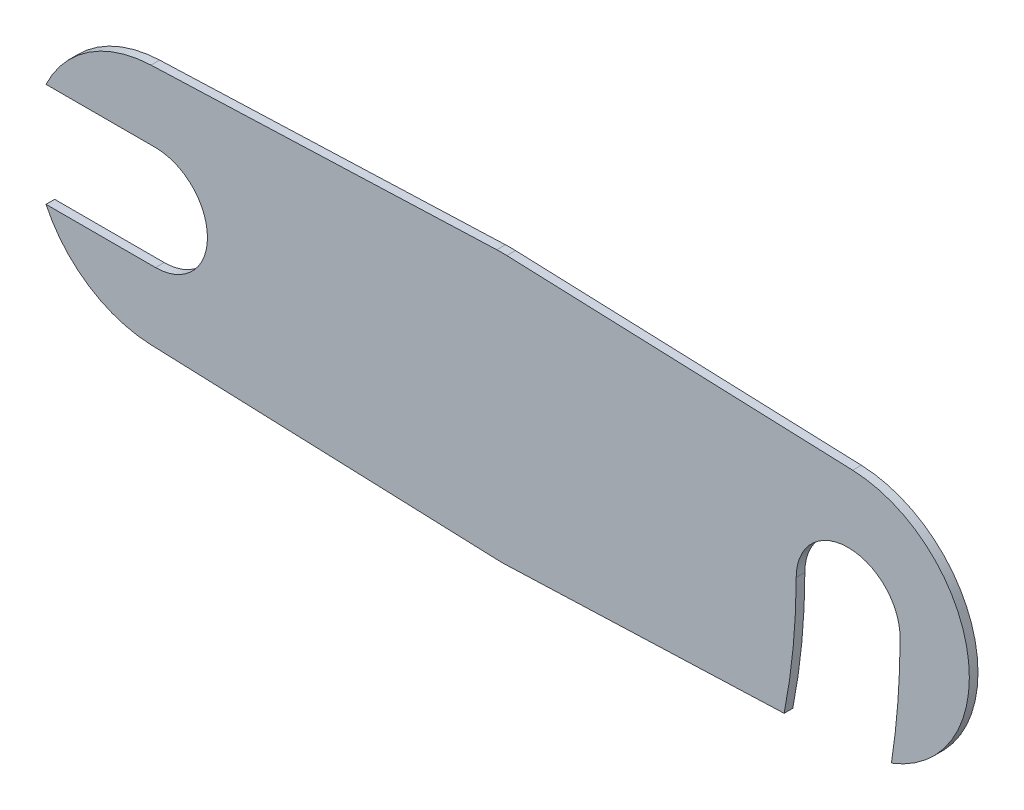
ISO-10303-21;
HEADER;
FILE_DESCRIPTION(('STEP AP214'),'2;1');
FILE_NAME('part.step','',(''),(''),'','','');
FILE_SCHEMA(('AUTOMOTIVE_DESIGN { 1 0 10303 214 1 1 1 1 }'));
ENDSEC;
DATA;
#1=APPLICATION_CONTEXT('core data for automotive mechanical design processes');
#2=APPLICATION_PROTOCOL_DEFINITION('international standard','automotive_design',2000,#1);
#3=PRODUCT_CONTEXT('',#1,'mechanical');
#4=PRODUCT('Part','Part','',(#3));
#5=PRODUCT_RELATED_PRODUCT_CATEGORY('part','',(#4));
#6=PRODUCT_DEFINITION_FORMATION('','',#4);
#7=PRODUCT_DEFINITION_CONTEXT('part definition',#1,'design');
#8=PRODUCT_DEFINITION('design','',#6,#7);
#9=PRODUCT_DEFINITION_SHAPE('','',#8);
#10=(LENGTH_UNIT() NAMED_UNIT(*) SI_UNIT(.MILLI.,.METRE.));
#11=(NAMED_UNIT(*) PLANE_ANGLE_UNIT() SI_UNIT($,.RADIAN.));
#12=(NAMED_UNIT(*) SI_UNIT($,.STERADIAN.) SOLID_ANGLE_UNIT());
#13=UNCERTAINTY_MEASURE_WITH_UNIT(LENGTH_MEASURE(1.E-05),#10,'distance_accuracy_value','');
#14=(GEOMETRIC_REPRESENTATION_CONTEXT(3) GLOBAL_UNCERTAINTY_ASSIGNED_CONTEXT((#13)) GLOBAL_UNIT_ASSIGNED_CONTEXT((#10,
#11,#12)) REPRESENTATION_CONTEXT('',''));
#15=CARTESIAN_POINT('',(0.,0.,0.));
#16=DIRECTION('',(0.,0.,1.));
#17=DIRECTION('',(1.,0.,0.));
#18=AXIS2_PLACEMENT_3D('',#15,#16,#17);
#19=CARTESIAN_POINT('',(0.,0.,0.5));
#20=DIRECTION('',(0.,0.,1.));
#21=DIRECTION('',(1.,0.,0.));
#22=AXIS2_PLACEMENT_3D('',#19,#20,#21);
#23=PLANE('',#22);
#24=CARTESIAN_POINT('',(20.,0.,0.5));
#25=DIRECTION('',(0.,0.,1.));
#26=DIRECTION('',(1.,0.,0.));
#27=AXIS2_PLACEMENT_3D('',#24,#25,#26);
#28=CIRCLE('',#27,3.);
#29=CARTESIAN_POINT('',(23.,0.,0.5));
#30=VERTEX_POINT('',#29);
#31=CARTESIAN_POINT('',(17.,0.,0.5));
#32=VERTEX_POINT('',#31);
#33=EDGE_CURVE('E159',#30,#32,#28,.T.);
#34=ORIENTED_EDGE('',*,*,#33,.F.);
#35=CARTESIAN_POINT('',(-20.,0.,0.5));
#36=DIRECTION('',(0.,0.,1.));
#37=DIRECTION('',(1.,0.,0.));
#38=AXIS2_PLACEMENT_3D('',#35,#36,#37);
#39=CIRCLE('',#38,43.);
#40=CARTESIAN_POINT('',(22.5,-6.53834841531101,0.5));
#41=VERTEX_POINT('',#40);
#42=EDGE_CURVE('E57',#30,#41,#39,.F.);
#43=ORIENTED_EDGE('',*,*,#42,.T.);
#44=CARTESIAN_POINT('',(20.,0.,0.5));
#45=DIRECTION('',(0.,0.,1.));
#46=DIRECTION('',(1.,0.,0.));
#47=AXIS2_PLACEMENT_3D('',#44,#45,#46);
#48=CIRCLE('',#47,7.);
#49=CARTESIAN_POINT('',(20.2625,6.99507639343561,0.5));
#50=VERTEX_POINT('',#49);
#51=EDGE_CURVE('E192',#41,#50,#48,.T.);
#52=ORIENTED_EDGE('',*,*,#51,.T.);
#53=DIRECTION('',(-0.999296627633657,0.0374999999999998,0.));
#54=VECTOR('',#53,1.);
#55=CARTESIAN_POINT('',(0.290624999999998,7.74454886416084,0.5));
#56=LINE('',#55,#54);
#57=CARTESIAN_POINT('',(0.290624999999998,7.74454886416084,0.5));
#58=VERTEX_POINT('',#57);
#59=EDGE_CURVE('E194',#50,#58,#56,.T.);
#60=ORIENTED_EDGE('',*,*,#59,.T.);
#61=CARTESIAN_POINT('',(0.,0.,0.5));
#62=DIRECTION('',(0.,0.,1.));
#63=DIRECTION('',(1.,0.,0.));
#64=AXIS2_PLACEMENT_3D('',#61,#62,#63);
#65=CIRCLE('',#64,7.75);
#66=CARTESIAN_POINT('',(-0.290625,7.74454886416085,0.5));
#67=VERTEX_POINT('',#66);
#68=EDGE_CURVE('E175',#58,#67,#65,.T.);
#69=ORIENTED_EDGE('',*,*,#68,.T.);
#70=DIRECTION('',(-0.999296627633657,-0.0375,0.));
#71=VECTOR('',#70,1.);
#72=CARTESIAN_POINT('',(-0.290625,7.74454886416085,0.5));
#73=LINE('',#72,#71);
#74=CARTESIAN_POINT('',(-20.2625,6.9950763934356,0.5));
#75=VERTEX_POINT('',#74);
#76=EDGE_CURVE('E178',#67,#75,#73,.T.);
#77=ORIENTED_EDGE('',*,*,#76,.T.);
#78=CARTESIAN_POINT('',(-20.,0.,0.5));
#79=DIRECTION('',(0.,0.,1.));
#80=DIRECTION('',(1.,0.,0.));
#81=AXIS2_PLACEMENT_3D('',#78,#79,#80);
#82=CIRCLE('',#81,7.);
#83=CARTESIAN_POINT('',(-26.3245553203368,3.,0.5));
#84=VERTEX_POINT('',#83);
#85=EDGE_CURVE('E182',#75,#84,#82,.T.);
#86=ORIENTED_EDGE('',*,*,#85,.T.);
#87=DIRECTION('',(-1.,0.,0.));
#88=VECTOR('',#87,1.);
#89=CARTESIAN_POINT('',(-20.,3.,0.5));
#90=LINE('',#89,#88);
#91=CARTESIAN_POINT('',(-20.,3.,0.5));
#92=VERTEX_POINT('',#91);
#93=EDGE_CURVE('E247',#92,#84,#90,.T.);
#94=ORIENTED_EDGE('',*,*,#93,.F.);
#95=CARTESIAN_POINT('',(-20.,0.,0.5));
#96=DIRECTION('',(0.,0.,1.));
#97=DIRECTION('',(1.,0.,0.));
#98=AXIS2_PLACEMENT_3D('',#95,#96,#97);
#99=CIRCLE('',#98,3.);
#100=CARTESIAN_POINT('',(-20.,-3.,0.5));
#101=VERTEX_POINT('',#100);
#102=EDGE_CURVE('E169',#101,#92,#99,.T.);
#103=ORIENTED_EDGE('',*,*,#102,.F.);
#104=DIRECTION('',(1.,0.,0.));
#105=VECTOR('',#104,1.);
#106=CARTESIAN_POINT('',(-20.,-3.,0.5));
#107=LINE('',#106,#105);
#108=CARTESIAN_POINT('',(-26.3245553203368,-3.,0.5));
#109=VERTEX_POINT('',#108);
#110=EDGE_CURVE('E243',#109,#101,#107,.T.);
#111=ORIENTED_EDGE('',*,*,#110,.F.);
#112=CARTESIAN_POINT('',(-20.2625,-6.9950763934356,0.5));
#113=VERTEX_POINT('',#112);
#114=EDGE_CURVE('E181',#109,#113,#82,.T.);
#115=ORIENTED_EDGE('',*,*,#114,.T.);
#116=DIRECTION('',(0.999296627633657,-0.0375,0.));
#117=VECTOR('',#116,1.);
#118=CARTESIAN_POINT('',(-0.290625,-7.74454886416085,0.5));
#119=LINE('',#118,#117);
#120=CARTESIAN_POINT('',(-0.290625,-7.74454886416085,0.5));
#121=VERTEX_POINT('',#120);
#122=EDGE_CURVE('E185',#113,#121,#119,.T.);
#123=ORIENTED_EDGE('',*,*,#122,.T.);
#124=CARTESIAN_POINT('',(0.,0.,0.5));
#125=DIRECTION('',(0.,0.,1.));
#126=DIRECTION('',(1.,0.,0.));
#127=AXIS2_PLACEMENT_3D('',#124,#125,#126);
#128=CIRCLE('',#127,7.75);
#129=CARTESIAN_POINT('',(0.290625000000003,-7.74454886416084,0.5));
#130=VERTEX_POINT('',#129);
#131=EDGE_CURVE('E187',#121,#130,#128,.T.);
#132=ORIENTED_EDGE('',*,*,#131,.T.);
#133=DIRECTION('',(0.999296627633657,0.0375000000000003,0.));
#134=VECTOR('',#133,1.);
#135=CARTESIAN_POINT('',(0.290625000000002,-7.74454886416084,0.5));
#136=LINE('',#135,#134);
#137=CARTESIAN_POINT('',(16.3038364291376,-7.14363076638377,0.5));
#138=VERTEX_POINT('',#137);
#139=EDGE_CURVE('E189',#130,#138,#136,.T.);
#140=ORIENTED_EDGE('',*,*,#139,.T.);
#141=CARTESIAN_POINT('',(-20.,0.,0.5));
#142=DIRECTION('',(0.,0.,1.));
#143=DIRECTION('',(1.,0.,0.));
#144=AXIS2_PLACEMENT_3D('',#141,#142,#143);
#145=CIRCLE('',#144,37.);
#146=EDGE_CURVE('E156',#32,#138,#145,.F.);
#147=ORIENTED_EDGE('',*,*,#146,.F.);
#148=EDGE_LOOP('',(#34,#43,#52,#60,#69,#77,#86,#94,#103,#111,#115,#123,#132,#140,#147));
#149=FACE_BOUND('',#148,.T.);
#150=ADVANCED_FACE('F34',(#149),#23,.T.);
#151=CARTESIAN_POINT('',(0.,0.,0.));
#152=DIRECTION('',(0.,0.,1.));
#153=DIRECTION('',(1.,0.,0.));
#154=AXIS2_PLACEMENT_3D('',#151,#152,#153);
#155=PLANE('',#154);
#156=CARTESIAN_POINT('',(-20.,0.,0.));
#157=DIRECTION('',(0.,0.,1.));
#158=DIRECTION('',(1.,0.,0.));
#159=AXIS2_PLACEMENT_3D('',#156,#157,#158);
#160=CIRCLE('',#159,43.);
#161=CARTESIAN_POINT('',(23.,0.,0.));
#162=VERTEX_POINT('',#161);
#163=CARTESIAN_POINT('',(22.5,-6.53834841531101,0.));
#164=VERTEX_POINT('',#163);
#165=EDGE_CURVE('E141',#162,#164,#160,.F.);
#166=ORIENTED_EDGE('',*,*,#165,.F.);
#167=CARTESIAN_POINT('',(20.,0.,0.));
#168=DIRECTION('',(0.,0.,1.));
#169=DIRECTION('',(1.,0.,0.));
#170=AXIS2_PLACEMENT_3D('',#167,#168,#169);
#171=CIRCLE('',#170,3.);
#172=CARTESIAN_POINT('',(17.,0.,0.));
#173=VERTEX_POINT('',#172);
#174=EDGE_CURVE('E153',#162,#173,#171,.T.);
#175=ORIENTED_EDGE('',*,*,#174,.T.);
#176=CARTESIAN_POINT('',(-20.,0.,0.));
#177=DIRECTION('',(0.,0.,1.));
#178=DIRECTION('',(1.,0.,0.));
#179=AXIS2_PLACEMENT_3D('',#176,#177,#178);
#180=CIRCLE('',#179,37.);
#181=CARTESIAN_POINT('',(16.3038364291376,-7.14363076638377,0.));
#182=VERTEX_POINT('',#181);
#183=EDGE_CURVE('E49',#173,#182,#180,.F.);
#184=ORIENTED_EDGE('',*,*,#183,.T.);
#185=DIRECTION('',(0.999296627633657,0.0375000000000003,0.));
#186=VECTOR('',#185,1.);
#187=CARTESIAN_POINT('',(0.290625000000002,-7.74454886416084,0.));
#188=LINE('',#187,#186);
#189=CARTESIAN_POINT('',(0.290625000000003,-7.74454886416084,0.));
#190=VERTEX_POINT('',#189);
#191=EDGE_CURVE('E209',#190,#182,#188,.T.);
#192=ORIENTED_EDGE('',*,*,#191,.F.);
#193=CARTESIAN_POINT('',(0.,0.,0.));
#194=DIRECTION('',(0.,0.,1.));
#195=DIRECTION('',(1.,0.,0.));
#196=AXIS2_PLACEMENT_3D('',#193,#194,#195);
#197=CIRCLE('',#196,7.75);
#198=CARTESIAN_POINT('',(-0.290625,-7.74454886416085,0.));
#199=VERTEX_POINT('',#198);
#200=EDGE_CURVE('E207',#199,#190,#197,.T.);
#201=ORIENTED_EDGE('',*,*,#200,.F.);
#202=DIRECTION('',(0.999296627633657,-0.0375,0.));
#203=VECTOR('',#202,1.);
#204=CARTESIAN_POINT('',(-0.290625,-7.74454886416085,0.));
#205=LINE('',#204,#203);
#206=CARTESIAN_POINT('',(-20.2625,-6.9950763934356,0.));
#207=VERTEX_POINT('',#206);
#208=EDGE_CURVE('E205',#207,#199,#205,.T.);
#209=ORIENTED_EDGE('',*,*,#208,.F.);
#210=CARTESIAN_POINT('',(-20.,0.,0.));
#211=DIRECTION('',(0.,0.,1.));
#212=DIRECTION('',(1.,0.,0.));
#213=AXIS2_PLACEMENT_3D('',#210,#211,#212);
#214=CIRCLE('',#213,7.);
#215=CARTESIAN_POINT('',(-26.3245553203368,-3.,0.));
#216=VERTEX_POINT('',#215);
#217=EDGE_CURVE('E201',#216,#207,#214,.T.);
#218=ORIENTED_EDGE('',*,*,#217,.F.);
#219=DIRECTION('',(1.,0.,0.));
#220=VECTOR('',#219,1.);
#221=CARTESIAN_POINT('',(-20.,-3.,0.));
#222=LINE('',#221,#220);
#223=CARTESIAN_POINT('',(-20.,-3.,0.));
#224=VERTEX_POINT('',#223);
#225=EDGE_CURVE('E242',#216,#224,#222,.T.);
#226=ORIENTED_EDGE('',*,*,#225,.T.);
#227=CARTESIAN_POINT('',(-20.,0.,0.));
#228=DIRECTION('',(0.,0.,1.));
#229=DIRECTION('',(1.,0.,0.));
#230=AXIS2_PLACEMENT_3D('',#227,#228,#229);
#231=CIRCLE('',#230,3.);
#232=CARTESIAN_POINT('',(-20.,3.,0.));
#233=VERTEX_POINT('',#232);
#234=EDGE_CURVE('E162',#224,#233,#231,.T.);
#235=ORIENTED_EDGE('',*,*,#234,.T.);
#236=DIRECTION('',(-1.,0.,0.));
#237=VECTOR('',#236,1.);
#238=CARTESIAN_POINT('',(-20.,3.,0.));
#239=LINE('',#238,#237);
#240=CARTESIAN_POINT('',(-26.3245553203368,3.,0.));
#241=VERTEX_POINT('',#240);
#242=EDGE_CURVE('E237',#233,#241,#239,.T.);
#243=ORIENTED_EDGE('',*,*,#242,.T.);
#244=CARTESIAN_POINT('',(-20.2625,6.9950763934356,0.));
#245=VERTEX_POINT('',#244);
#246=EDGE_CURVE('E202',#245,#241,#214,.T.);
#247=ORIENTED_EDGE('',*,*,#246,.F.);
#248=DIRECTION('',(-0.999296627633657,-0.0375,0.));
#249=VECTOR('',#248,1.);
#250=CARTESIAN_POINT('',(-0.290625,7.74454886416085,0.));
#251=LINE('',#250,#249);
#252=CARTESIAN_POINT('',(-0.290625,7.74454886416085,0.));
#253=VERTEX_POINT('',#252);
#254=EDGE_CURVE('E199',#253,#245,#251,.T.);
#255=ORIENTED_EDGE('',*,*,#254,.F.);
#256=CARTESIAN_POINT('',(0.,0.,0.));
#257=DIRECTION('',(0.,0.,1.));
#258=DIRECTION('',(1.,0.,0.));
#259=AXIS2_PLACEMENT_3D('',#256,#257,#258);
#260=CIRCLE('',#259,7.75);
#261=CARTESIAN_POINT('',(0.290624999999998,7.74454886416084,0.));
#262=VERTEX_POINT('',#261);
#263=EDGE_CURVE('E172',#262,#253,#260,.T.);
#264=ORIENTED_EDGE('',*,*,#263,.F.);
#265=DIRECTION('',(-0.999296627633657,0.0374999999999998,0.));
#266=VECTOR('',#265,1.);
#267=CARTESIAN_POINT('',(0.290624999999998,7.74454886416084,0.));
#268=LINE('',#267,#266);
#269=CARTESIAN_POINT('',(20.2625,6.99507639343561,0.));
#270=VERTEX_POINT('',#269);
#271=EDGE_CURVE('E179',#270,#262,#268,.T.);
#272=ORIENTED_EDGE('',*,*,#271,.F.);
#273=CARTESIAN_POINT('',(20.,0.,0.));
#274=DIRECTION('',(0.,0.,1.));
#275=DIRECTION('',(1.,0.,0.));
#276=AXIS2_PLACEMENT_3D('',#273,#274,#275);
#277=CIRCLE('',#276,7.);
#278=EDGE_CURVE('E155',#164,#270,#277,.T.);
#279=ORIENTED_EDGE('',*,*,#278,.F.);
#280=EDGE_LOOP('',(#166,#175,#184,#192,#201,#209,#218,#226,#235,#243,#247,#255,#264,#272,#279));
#281=FACE_BOUND('',#280,.T.);
#282=ADVANCED_FACE('F152',(#281),#155,.F.);
#283=CARTESIAN_POINT('',(20.,0.,0.5));
#284=DIRECTION('',(0.,0.,-1.));
#285=DIRECTION('',(-1.,0.,0.));
#286=AXIS2_PLACEMENT_3D('',#283,#284,#285);
#287=CYLINDRICAL_SURFACE('',#286,7.);
#288=DIRECTION('',(0.,0.,1.));
#289=VECTOR('',#288,1.);
#290=CARTESIAN_POINT('',(22.5,-6.53834841531101,0.));
#291=LINE('',#290,#289);
#292=EDGE_CURVE('E251',#164,#41,#291,.T.);
#293=ORIENTED_EDGE('',*,*,#292,.F.);
#294=ORIENTED_EDGE('',*,*,#278,.T.);
#295=DIRECTION('',(0.,0.,-1.));
#296=VECTOR('',#295,1.);
#297=CARTESIAN_POINT('',(20.2625,6.99507639343561,0.5));
#298=LINE('',#297,#296);
#299=EDGE_CURVE('E216',#50,#270,#298,.T.);
#300=ORIENTED_EDGE('',*,*,#299,.F.);
#301=ORIENTED_EDGE('',*,*,#51,.F.);
#302=EDGE_LOOP('',(#293,#294,#300,#301));
#303=FACE_BOUND('',#302,.T.);
#304=ADVANCED_FACE('F295',(#303),#287,.T.);
#305=CARTESIAN_POINT('',(20.,0.,0.5));
#306=DIRECTION('',(0.,0.,-1.));
#307=DIRECTION('',(-1.,0.,0.));
#308=AXIS2_PLACEMENT_3D('',#305,#306,#307);
#309=CYLINDRICAL_SURFACE('',#308,3.);
#310=ORIENTED_EDGE('',*,*,#174,.F.);
#311=DIRECTION('',(0.,0.,1.));
#312=VECTOR('',#311,1.);
#313=CARTESIAN_POINT('',(23.,0.,0.));
#314=LINE('',#313,#312);
#315=EDGE_CURVE('E138',#162,#30,#314,.T.);
#316=ORIENTED_EDGE('',*,*,#315,.T.);
#317=ORIENTED_EDGE('',*,*,#33,.T.);
#318=DIRECTION('',(0.,0.,1.));
#319=VECTOR('',#318,1.);
#320=CARTESIAN_POINT('',(17.,0.,0.));
#321=LINE('',#320,#319);
#322=EDGE_CURVE('E147',#173,#32,#321,.T.);
#323=ORIENTED_EDGE('',*,*,#322,.F.);
#324=EDGE_LOOP('',(#310,#316,#317,#323));
#325=FACE_BOUND('',#324,.T.);
#326=ADVANCED_FACE('F158',(#325),#309,.F.);
#327=CARTESIAN_POINT('',(-20.,0.,0.5));
#328=DIRECTION('',(0.,0.,-1.));
#329=DIRECTION('',(-1.,0.,0.));
#330=AXIS2_PLACEMENT_3D('',#327,#328,#329);
#331=CYLINDRICAL_SURFACE('',#330,7.);
#332=ORIENTED_EDGE('',*,*,#114,.F.);
#333=DIRECTION('',(0.,0.,1.));
#334=VECTOR('',#333,1.);
#335=CARTESIAN_POINT('',(-26.3245553203368,-3.,0.));
#336=LINE('',#335,#334);
#337=EDGE_CURVE('E165',#216,#109,#336,.T.);
#338=ORIENTED_EDGE('',*,*,#337,.F.);
#339=ORIENTED_EDGE('',*,*,#217,.T.);
#340=DIRECTION('',(0.,0.,-1.));
#341=VECTOR('',#340,1.);
#342=CARTESIAN_POINT('',(-20.2625,-6.9950763934356,0.5));
#343=LINE('',#342,#341);
#344=EDGE_CURVE('E225',#113,#207,#343,.T.);
#345=ORIENTED_EDGE('',*,*,#344,.F.);
#346=EDGE_LOOP('',(#332,#338,#339,#345));
#347=FACE_BOUND('',#346,.T.);
#348=ADVANCED_FACE('F271',(#347),#331,.T.);
#349=CARTESIAN_POINT('',(0.,0.,0.5));
#350=DIRECTION('',(0.,0.,-1.));
#351=DIRECTION('',(-1.,0.,0.));
#352=AXIS2_PLACEMENT_3D('',#349,#350,#351);
#353=CYLINDRICAL_SURFACE('',#352,7.75);
#354=ORIENTED_EDGE('',*,*,#263,.T.);
#355=DIRECTION('',(0.,0.,-1.));
#356=VECTOR('',#355,1.);
#357=CARTESIAN_POINT('',(-0.290625,7.74454886416085,0.5));
#358=LINE('',#357,#356);
#359=EDGE_CURVE('E11',#67,#253,#358,.T.);
#360=ORIENTED_EDGE('',*,*,#359,.F.);
#361=ORIENTED_EDGE('',*,*,#68,.F.);
#362=DIRECTION('',(0.,0.,-1.));
#363=VECTOR('',#362,1.);
#364=CARTESIAN_POINT('',(0.290624999999998,7.74454886416084,0.5));
#365=LINE('',#364,#363);
#366=EDGE_CURVE('E196',#58,#262,#365,.T.);
#367=ORIENTED_EDGE('',*,*,#366,.T.);
#368=EDGE_LOOP('',(#354,#360,#361,#367));
#369=FACE_BOUND('',#368,.T.);
#370=ADVANCED_FACE('F36',(#369),#353,.T.);
#371=CARTESIAN_POINT('',(-0.290625,7.74454886416085,0.5));
#372=DIRECTION('',(0.0375,-0.999296627633657,0.));
#373=DIRECTION('',(0.999296627633657,0.0375,0.));
#374=AXIS2_PLACEMENT_3D('',#371,#372,#373);
#375=PLANE('',#374);
#376=ORIENTED_EDGE('',*,*,#254,.T.);
#377=DIRECTION('',(0.,0.,-1.));
#378=VECTOR('',#377,1.);
#379=CARTESIAN_POINT('',(-20.2625,6.9950763934356,0.5));
#380=LINE('',#379,#378);
#381=EDGE_CURVE('E42',#75,#245,#380,.T.);
#382=ORIENTED_EDGE('',*,*,#381,.F.);
#383=ORIENTED_EDGE('',*,*,#76,.F.);
#384=ORIENTED_EDGE('',*,*,#359,.T.);
#385=EDGE_LOOP('',(#376,#382,#383,#384));
#386=FACE_BOUND('',#385,.T.);
#387=ADVANCED_FACE('F303',(#386),#375,.F.);
#388=ORIENTED_EDGE('',*,*,#246,.T.);
#389=DIRECTION('',(0.,0.,1.));
#390=VECTOR('',#389,1.);
#391=CARTESIAN_POINT('',(-26.3245553203368,3.,0.));
#392=LINE('',#391,#390);
#393=EDGE_CURVE('E254',#241,#84,#392,.T.);
#394=ORIENTED_EDGE('',*,*,#393,.T.);
#395=ORIENTED_EDGE('',*,*,#85,.F.);
#396=ORIENTED_EDGE('',*,*,#381,.T.);
#397=EDGE_LOOP('',(#388,#394,#395,#396));
#398=FACE_BOUND('',#397,.T.);
#399=ADVANCED_FACE('F232',(#398),#331,.T.);
#400=CARTESIAN_POINT('',(-0.290625,-7.74454886416085,0.5));
#401=DIRECTION('',(0.0375,0.999296627633657,0.));
#402=DIRECTION('',(-0.999296627633657,0.0375,0.));
#403=AXIS2_PLACEMENT_3D('',#400,#401,#402);
#404=PLANE('',#403);
#405=ORIENTED_EDGE('',*,*,#208,.T.);
#406=DIRECTION('',(0.,0.,-1.));
#407=VECTOR('',#406,1.);
#408=CARTESIAN_POINT('',(-0.290625,-7.74454886416085,0.5));
#409=LINE('',#408,#407);
#410=EDGE_CURVE('E222',#121,#199,#409,.T.);
#411=ORIENTED_EDGE('',*,*,#410,.F.);
#412=ORIENTED_EDGE('',*,*,#122,.F.);
#413=ORIENTED_EDGE('',*,*,#344,.T.);
#414=EDGE_LOOP('',(#405,#411,#412,#413));
#415=FACE_BOUND('',#414,.T.);
#416=ADVANCED_FACE('F274',(#415),#404,.F.);
#417=CARTESIAN_POINT('',(0.,0.,0.5));
#418=DIRECTION('',(0.,0.,-1.));
#419=DIRECTION('',(-1.,0.,0.));
#420=AXIS2_PLACEMENT_3D('',#417,#418,#419);
#421=CYLINDRICAL_SURFACE('',#420,7.75);
#422=ORIENTED_EDGE('',*,*,#200,.T.);
#423=DIRECTION('',(0.,0.,-1.));
#424=VECTOR('',#423,1.);
#425=CARTESIAN_POINT('',(0.290625000000003,-7.74454886416084,0.5));
#426=LINE('',#425,#424);
#427=EDGE_CURVE('E219',#130,#190,#426,.T.);
#428=ORIENTED_EDGE('',*,*,#427,.F.);
#429=ORIENTED_EDGE('',*,*,#131,.F.);
#430=ORIENTED_EDGE('',*,*,#410,.T.);
#431=EDGE_LOOP('',(#422,#428,#429,#430));
#432=FACE_BOUND('',#431,.T.);
#433=ADVANCED_FACE('F281',(#432),#421,.T.);
#434=CARTESIAN_POINT('',(0.290625000000002,-7.74454886416084,0.5));
#435=DIRECTION('',(-0.0375000000000003,0.999296627633657,0.));
#436=DIRECTION('',(-0.999296627633657,-0.0375000000000003,0.));
#437=AXIS2_PLACEMENT_3D('',#434,#435,#436);
#438=PLANE('',#437);
#439=ORIENTED_EDGE('',*,*,#191,.T.);
#440=DIRECTION('',(0.,0.,1.));
#441=VECTOR('',#440,1.);
#442=CARTESIAN_POINT('',(16.3038364291376,-7.14363076638377,0.));
#443=LINE('',#442,#441);
#444=EDGE_CURVE('E286',#182,#138,#443,.T.);
#445=ORIENTED_EDGE('',*,*,#444,.T.);
#446=ORIENTED_EDGE('',*,*,#139,.F.);
#447=ORIENTED_EDGE('',*,*,#427,.T.);
#448=EDGE_LOOP('',(#439,#445,#446,#447));
#449=FACE_BOUND('',#448,.T.);
#450=ADVANCED_FACE('F285',(#449),#438,.F.);
#451=CARTESIAN_POINT('',(0.290624999999998,7.74454886416084,0.5));
#452=DIRECTION('',(-0.0374999999999998,-0.999296627633657,0.));
#453=DIRECTION('',(0.999296627633657,-0.0374999999999998,0.));
#454=AXIS2_PLACEMENT_3D('',#451,#452,#453);
#455=PLANE('',#454);
#456=ORIENTED_EDGE('',*,*,#271,.T.);
#457=ORIENTED_EDGE('',*,*,#366,.F.);
#458=ORIENTED_EDGE('',*,*,#59,.F.);
#459=ORIENTED_EDGE('',*,*,#299,.T.);
#460=EDGE_LOOP('',(#456,#457,#458,#459));
#461=FACE_BOUND('',#460,.T.);
#462=ADVANCED_FACE('F299',(#461),#455,.F.);
#463=CARTESIAN_POINT('',(-20.,0.,0.5));
#464=DIRECTION('',(0.,0.,-1.));
#465=DIRECTION('',(-1.,0.,0.));
#466=AXIS2_PLACEMENT_3D('',#463,#464,#465);
#467=CYLINDRICAL_SURFACE('',#466,3.);
#468=DIRECTION('',(0.,0.,1.));
#469=VECTOR('',#468,1.);
#470=CARTESIAN_POINT('',(-20.,-3.,0.));
#471=LINE('',#470,#469);
#472=EDGE_CURVE('E160',#224,#101,#471,.T.);
#473=ORIENTED_EDGE('',*,*,#472,.T.);
#474=ORIENTED_EDGE('',*,*,#102,.T.);
#475=DIRECTION('',(0.,0.,1.));
#476=VECTOR('',#475,1.);
#477=CARTESIAN_POINT('',(-20.,3.,0.));
#478=LINE('',#477,#476);
#479=EDGE_CURVE('E245',#233,#92,#478,.T.);
#480=ORIENTED_EDGE('',*,*,#479,.F.);
#481=ORIENTED_EDGE('',*,*,#234,.F.);
#482=EDGE_LOOP('',(#473,#474,#480,#481));
#483=FACE_BOUND('',#482,.T.);
#484=ADVANCED_FACE('F261',(#483),#467,.F.);
#485=CARTESIAN_POINT('',(-20.,3.,0.));
#486=DIRECTION('',(0.,1.,0.));
#487=DIRECTION('',(-1.,0.,0.));
#488=AXIS2_PLACEMENT_3D('',#485,#486,#487);
#489=PLANE('',#488);
#490=ORIENTED_EDGE('',*,*,#93,.T.);
#491=ORIENTED_EDGE('',*,*,#393,.F.);
#492=ORIENTED_EDGE('',*,*,#242,.F.);
#493=ORIENTED_EDGE('',*,*,#479,.T.);
#494=EDGE_LOOP('',(#490,#491,#492,#493));
#495=FACE_BOUND('',#494,.T.);
#496=ADVANCED_FACE('F256',(#495),#489,.F.);
#497=CARTESIAN_POINT('',(-20.,-3.,0.));
#498=DIRECTION('',(0.,-1.,0.));
#499=DIRECTION('',(0.,0.,-1.));
#500=AXIS2_PLACEMENT_3D('',#497,#498,#499);
#501=PLANE('',#500);
#502=ORIENTED_EDGE('',*,*,#110,.T.);
#503=ORIENTED_EDGE('',*,*,#472,.F.);
#504=ORIENTED_EDGE('',*,*,#225,.F.);
#505=ORIENTED_EDGE('',*,*,#337,.T.);
#506=EDGE_LOOP('',(#502,#503,#504,#505));
#507=FACE_BOUND('',#506,.T.);
#508=ADVANCED_FACE('F263',(#507),#501,.F.);
#509=CARTESIAN_POINT('',(-20.,0.,0.));
#510=DIRECTION('',(0.,0.,1.));
#511=DIRECTION('',(1.,0.,0.));
#512=AXIS2_PLACEMENT_3D('',#509,#510,#511);
#513=CYLINDRICAL_SURFACE('',#512,37.);
#514=ORIENTED_EDGE('',*,*,#146,.T.);
#515=ORIENTED_EDGE('',*,*,#444,.F.);
#516=ORIENTED_EDGE('',*,*,#183,.F.);
#517=ORIENTED_EDGE('',*,*,#322,.T.);
#518=EDGE_LOOP('',(#514,#515,#516,#517));
#519=FACE_BOUND('',#518,.T.);
#520=ADVANCED_FACE('F364',(#519),#513,.T.);
#521=CARTESIAN_POINT('',(-20.,0.,0.));
#522=DIRECTION('',(0.,0.,1.));
#523=DIRECTION('',(1.,0.,0.));
#524=AXIS2_PLACEMENT_3D('',#521,#522,#523);
#525=CYLINDRICAL_SURFACE('',#524,43.);
#526=ORIENTED_EDGE('',*,*,#42,.F.);
#527=ORIENTED_EDGE('',*,*,#315,.F.);
#528=ORIENTED_EDGE('',*,*,#165,.T.);
#529=ORIENTED_EDGE('',*,*,#292,.T.);
#530=EDGE_LOOP('',(#526,#527,#528,#529));
#531=FACE_BOUND('',#530,.T.);
#532=ADVANCED_FACE('F140',(#531),#525,.F.);
#533=CLOSED_SHELL('',(#150,#282,#304,#326,#348,#370,#387,#399,#416,#433,#450,#462,#484,#496,
#508,#520,#532));
#534=MANIFOLD_SOLID_BREP('B2',#533);
#535=ADVANCED_BREP_SHAPE_REPRESENTATION('',(#18,#534),#14);
#536=SHAPE_DEFINITION_REPRESENTATION(#9,#535);
ENDSEC;
END-ISO-10303-21;
